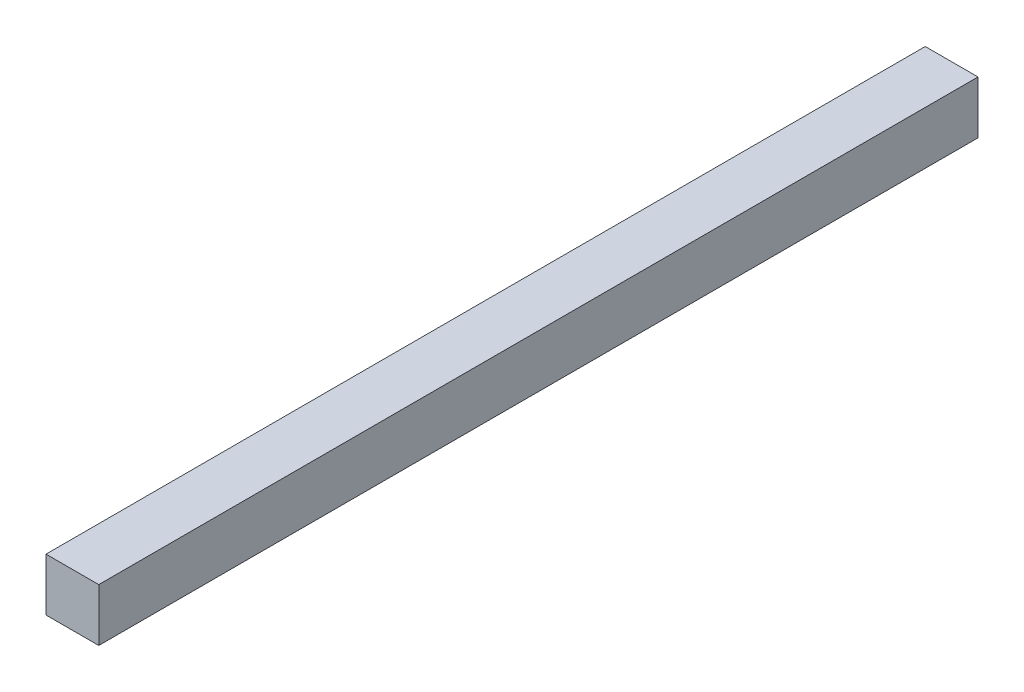
ISO-10303-21;
HEADER;
FILE_DESCRIPTION(('STEP AP214'),'2;1');
FILE_NAME('part.step','',(''),(''),'','','');
FILE_SCHEMA(('AUTOMOTIVE_DESIGN { 1 0 10303 214 1 1 1 1 }'));
ENDSEC;
DATA;
#1=APPLICATION_CONTEXT('core data for automotive mechanical design processes');
#2=APPLICATION_PROTOCOL_DEFINITION('international standard','automotive_design',2000,#1);
#3=PRODUCT_CONTEXT('',#1,'mechanical');
#4=PRODUCT('Part','Part','',(#3));
#5=PRODUCT_RELATED_PRODUCT_CATEGORY('part','',(#4));
#6=PRODUCT_DEFINITION_FORMATION('','',#4);
#7=PRODUCT_DEFINITION_CONTEXT('part definition',#1,'design');
#8=PRODUCT_DEFINITION('design','',#6,#7);
#9=PRODUCT_DEFINITION_SHAPE('','',#8);
#10=(LENGTH_UNIT() NAMED_UNIT(*) SI_UNIT(.MILLI.,.METRE.));
#11=(NAMED_UNIT(*) PLANE_ANGLE_UNIT() SI_UNIT($,.RADIAN.));
#12=(NAMED_UNIT(*) SI_UNIT($,.STERADIAN.) SOLID_ANGLE_UNIT());
#13=UNCERTAINTY_MEASURE_WITH_UNIT(LENGTH_MEASURE(1.E-05),#10,'distance_accuracy_value','');
#14=(GEOMETRIC_REPRESENTATION_CONTEXT(3) GLOBAL_UNCERTAINTY_ASSIGNED_CONTEXT((#13)) GLOBAL_UNIT_ASSIGNED_CONTEXT((#10,
#11,#12)) REPRESENTATION_CONTEXT('',''));
#15=CARTESIAN_POINT('',(0.,0.,0.));
#16=DIRECTION('',(0.,0.,1.));
#17=DIRECTION('',(1.,0.,0.));
#18=AXIS2_PLACEMENT_3D('',#15,#16,#17);
#19=CARTESIAN_POINT('',(15.,-15.,500.));
#20=DIRECTION('',(-1.,0.,0.));
#21=DIRECTION('',(0.,0.,1.));
#22=AXIS2_PLACEMENT_3D('',#19,#20,#21);
#23=PLANE('',#22);
#24=DIRECTION('',(0.,1.,0.));
#25=VECTOR('',#24,1.);
#26=CARTESIAN_POINT('',(15.,-15.,0.));
#27=LINE('',#26,#25);
#28=CARTESIAN_POINT('',(15.,-15.,0.));
#29=VERTEX_POINT('',#28);
#30=CARTESIAN_POINT('',(15.,15.,0.));
#31=VERTEX_POINT('',#30);
#32=EDGE_CURVE('E107',#29,#31,#27,.T.);
#33=ORIENTED_EDGE('',*,*,#32,.T.);
#34=DIRECTION('',(0.,0.,-1.));
#35=VECTOR('',#34,1.);
#36=CARTESIAN_POINT('',(15.,15.,500.));
#37=LINE('',#36,#35);
#38=CARTESIAN_POINT('',(15.,15.,500.));
#39=VERTEX_POINT('',#38);
#40=EDGE_CURVE('E11',#39,#31,#37,.T.);
#41=ORIENTED_EDGE('',*,*,#40,.F.);
#42=DIRECTION('',(0.,1.,0.));
#43=VECTOR('',#42,1.);
#44=CARTESIAN_POINT('',(15.,-15.,500.));
#45=LINE('',#44,#43);
#46=CARTESIAN_POINT('',(15.,-15.,500.));
#47=VERTEX_POINT('',#46);
#48=EDGE_CURVE('E91',#47,#39,#45,.T.);
#49=ORIENTED_EDGE('',*,*,#48,.F.);
#50=DIRECTION('',(0.,0.,-1.));
#51=VECTOR('',#50,1.);
#52=CARTESIAN_POINT('',(15.,-15.,500.));
#53=LINE('',#52,#51);
#54=EDGE_CURVE('E103',#47,#29,#53,.T.);
#55=ORIENTED_EDGE('',*,*,#54,.T.);
#56=EDGE_LOOP('',(#33,#41,#49,#55));
#57=FACE_BOUND('',#56,.T.);
#58=ADVANCED_FACE('F39',(#57),#23,.F.);
#59=CARTESIAN_POINT('',(-15.,15.,500.));
#60=DIRECTION('',(0.,-1.,0.));
#61=DIRECTION('',(0.,0.,-1.));
#62=AXIS2_PLACEMENT_3D('',#59,#60,#61);
#63=PLANE('',#62);
#64=DIRECTION('',(-1.,0.,0.));
#65=VECTOR('',#64,1.);
#66=CARTESIAN_POINT('',(-15.,15.,0.));
#67=LINE('',#66,#65);
#68=CARTESIAN_POINT('',(-15.,15.,0.));
#69=VERTEX_POINT('',#68);
#70=EDGE_CURVE('E96',#31,#69,#67,.T.);
#71=ORIENTED_EDGE('',*,*,#70,.T.);
#72=DIRECTION('',(0.,0.,-1.));
#73=VECTOR('',#72,1.);
#74=CARTESIAN_POINT('',(-15.,15.,500.));
#75=LINE('',#74,#73);
#76=CARTESIAN_POINT('',(-15.,15.,500.));
#77=VERTEX_POINT('',#76);
#78=EDGE_CURVE('E48',#77,#69,#75,.T.);
#79=ORIENTED_EDGE('',*,*,#78,.F.);
#80=DIRECTION('',(-1.,0.,0.));
#81=VECTOR('',#80,1.);
#82=CARTESIAN_POINT('',(-15.,15.,500.));
#83=LINE('',#82,#81);
#84=EDGE_CURVE('E86',#39,#77,#83,.T.);
#85=ORIENTED_EDGE('',*,*,#84,.F.);
#86=ORIENTED_EDGE('',*,*,#40,.T.);
#87=EDGE_LOOP('',(#71,#79,#85,#86));
#88=FACE_BOUND('',#87,.T.);
#89=ADVANCED_FACE('F95',(#88),#63,.F.);
#90=CARTESIAN_POINT('',(-15.,-15.,500.));
#91=DIRECTION('',(1.,0.,0.));
#92=DIRECTION('',(0.,0.,-1.));
#93=AXIS2_PLACEMENT_3D('',#90,#91,#92);
#94=PLANE('',#93);
#95=DIRECTION('',(0.,-1.,0.));
#96=VECTOR('',#95,1.);
#97=CARTESIAN_POINT('',(-15.,-15.,0.));
#98=LINE('',#97,#96);
#99=CARTESIAN_POINT('',(-15.,-15.,0.));
#100=VERTEX_POINT('',#99);
#101=EDGE_CURVE('E73',#69,#100,#98,.T.);
#102=ORIENTED_EDGE('',*,*,#101,.T.);
#103=DIRECTION('',(0.,0.,-1.));
#104=VECTOR('',#103,1.);
#105=CARTESIAN_POINT('',(-15.,-15.,500.));
#106=LINE('',#105,#104);
#107=CARTESIAN_POINT('',(-15.,-15.,500.));
#108=VERTEX_POINT('',#107);
#109=EDGE_CURVE('E98',#108,#100,#106,.T.);
#110=ORIENTED_EDGE('',*,*,#109,.F.);
#111=DIRECTION('',(0.,-1.,0.));
#112=VECTOR('',#111,1.);
#113=CARTESIAN_POINT('',(-15.,-15.,500.));
#114=LINE('',#113,#112);
#115=EDGE_CURVE('E89',#77,#108,#114,.T.);
#116=ORIENTED_EDGE('',*,*,#115,.F.);
#117=ORIENTED_EDGE('',*,*,#78,.T.);
#118=EDGE_LOOP('',(#102,#110,#116,#117));
#119=FACE_BOUND('',#118,.T.);
#120=ADVANCED_FACE('F99',(#119),#94,.F.);
#121=CARTESIAN_POINT('',(-15.,-15.,500.));
#122=DIRECTION('',(0.,1.,0.));
#123=DIRECTION('',(0.,0.,1.));
#124=AXIS2_PLACEMENT_3D('',#121,#122,#123);
#125=PLANE('',#124);
#126=DIRECTION('',(1.,0.,0.));
#127=VECTOR('',#126,1.);
#128=CARTESIAN_POINT('',(-15.,-15.,0.));
#129=LINE('',#128,#127);
#130=EDGE_CURVE('E79',#100,#29,#129,.T.);
#131=ORIENTED_EDGE('',*,*,#130,.T.);
#132=ORIENTED_EDGE('',*,*,#54,.F.);
#133=DIRECTION('',(1.,0.,0.));
#134=VECTOR('',#133,1.);
#135=CARTESIAN_POINT('',(-15.,-15.,500.));
#136=LINE('',#135,#134);
#137=EDGE_CURVE('E56',#108,#47,#136,.T.);
#138=ORIENTED_EDGE('',*,*,#137,.F.);
#139=ORIENTED_EDGE('',*,*,#109,.T.);
#140=EDGE_LOOP('',(#131,#132,#138,#139));
#141=FACE_BOUND('',#140,.T.);
#142=ADVANCED_FACE('F120',(#141),#125,.F.);
#143=CARTESIAN_POINT('',(0.,0.,500.));
#144=DIRECTION('',(0.,0.,-1.));
#145=DIRECTION('',(-1.,0.,0.));
#146=AXIS2_PLACEMENT_3D('',#143,#144,#145);
#147=PLANE('',#146);
#148=ORIENTED_EDGE('',*,*,#48,.T.);
#149=ORIENTED_EDGE('',*,*,#84,.T.);
#150=ORIENTED_EDGE('',*,*,#115,.T.);
#151=ORIENTED_EDGE('',*,*,#137,.T.);
#152=EDGE_LOOP('',(#148,#149,#150,#151));
#153=FACE_BOUND('',#152,.T.);
#154=ADVANCED_FACE('F87',(#153),#147,.F.);
#155=CARTESIAN_POINT('',(0.,0.,0.));
#156=DIRECTION('',(0.,0.,-1.));
#157=DIRECTION('',(-1.,0.,0.));
#158=AXIS2_PLACEMENT_3D('',#155,#156,#157);
#159=PLANE('',#158);
#160=ORIENTED_EDGE('',*,*,#32,.F.);
#161=ORIENTED_EDGE('',*,*,#130,.F.);
#162=ORIENTED_EDGE('',*,*,#101,.F.);
#163=ORIENTED_EDGE('',*,*,#70,.F.);
#164=EDGE_LOOP('',(#160,#161,#162,#163));
#165=FACE_BOUND('',#164,.T.);
#166=ADVANCED_FACE('F123',(#165),#159,.T.);
#167=CLOSED_SHELL('',(#58,#89,#120,#142,#154,#166));
#168=MANIFOLD_SOLID_BREP('B2',#167);
#169=ADVANCED_BREP_SHAPE_REPRESENTATION('',(#18,#168),#14);
#170=SHAPE_DEFINITION_REPRESENTATION(#9,#169);
ENDSEC;
END-ISO-10303-21;
